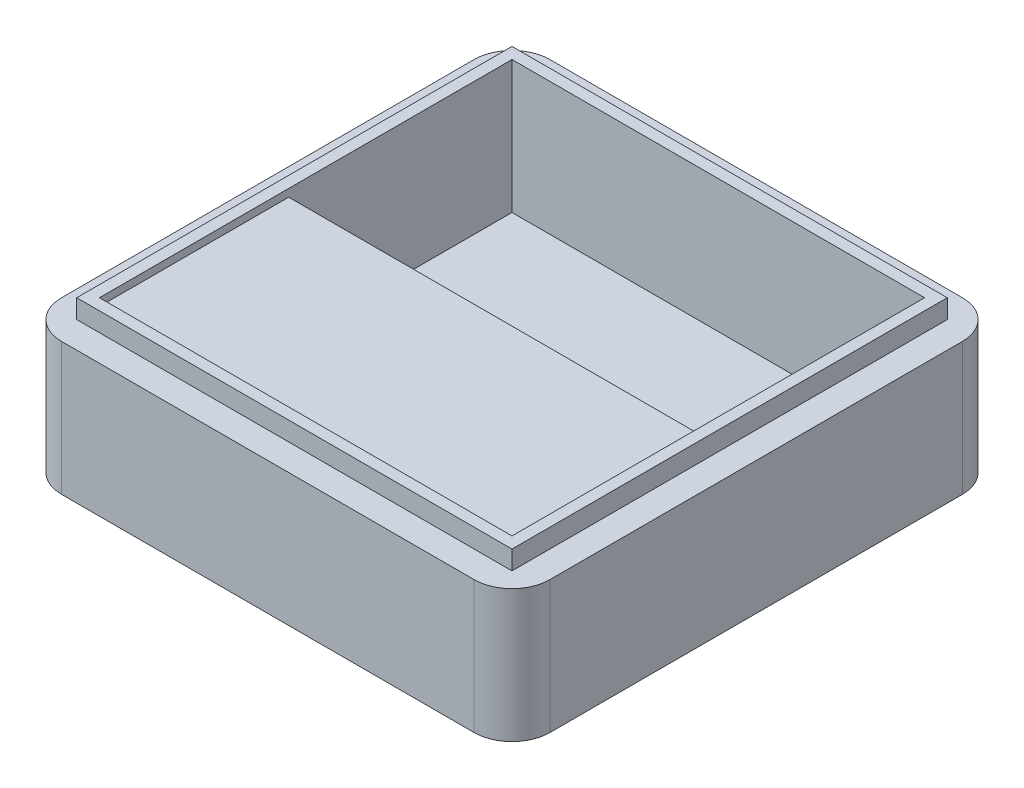
ISO-10303-21;
HEADER;
FILE_DESCRIPTION(('STEP AP214'),'2;1');
FILE_NAME('part.step','',(''),(''),'','','');
FILE_SCHEMA(('AUTOMOTIVE_DESIGN { 1 0 10303 214 1 1 1 1 }'));
ENDSEC;
DATA;
#1=APPLICATION_CONTEXT('core data for automotive mechanical design processes');
#2=APPLICATION_PROTOCOL_DEFINITION('international standard','automotive_design',2000,#1);
#3=PRODUCT_CONTEXT('',#1,'mechanical');
#4=PRODUCT('Part','Part','',(#3));
#5=PRODUCT_RELATED_PRODUCT_CATEGORY('part','',(#4));
#6=PRODUCT_DEFINITION_FORMATION('','',#4);
#7=PRODUCT_DEFINITION_CONTEXT('part definition',#1,'design');
#8=PRODUCT_DEFINITION('design','',#6,#7);
#9=PRODUCT_DEFINITION_SHAPE('','',#8);
#10=(LENGTH_UNIT() NAMED_UNIT(*) SI_UNIT(.MILLI.,.METRE.));
#11=(NAMED_UNIT(*) PLANE_ANGLE_UNIT() SI_UNIT($,.RADIAN.));
#12=(NAMED_UNIT(*) SI_UNIT($,.STERADIAN.) SOLID_ANGLE_UNIT());
#13=UNCERTAINTY_MEASURE_WITH_UNIT(LENGTH_MEASURE(1.E-05),#10,'distance_accuracy_value','');
#14=(GEOMETRIC_REPRESENTATION_CONTEXT(3) GLOBAL_UNCERTAINTY_ASSIGNED_CONTEXT((#13)) GLOBAL_UNIT_ASSIGNED_CONTEXT((#10,
#11,#12)) REPRESENTATION_CONTEXT('',''));
#15=CARTESIAN_POINT('',(0.,0.,0.));
#16=DIRECTION('',(0.,0.,1.));
#17=DIRECTION('',(1.,0.,0.));
#18=AXIS2_PLACEMENT_3D('',#15,#16,#17);
#19=CARTESIAN_POINT('',(-54.5,-189.149278298667,54.5));
#20=DIRECTION('',(0.,0.,1.));
#21=DIRECTION('',(1.,0.,0.));
#22=AXIS2_PLACEMENT_3D('',#19,#20,#21);
#23=PLANE('',#22);
#24=DIRECTION('',(1.,0.,0.));
#25=VECTOR('',#24,1.);
#26=CARTESIAN_POINT('',(54.5,3.,54.5));
#27=LINE('',#26,#25);
#28=CARTESIAN_POINT('',(-54.5,3.,54.5));
#29=VERTEX_POINT('',#28);
#30=CARTESIAN_POINT('',(54.5,3.,54.5));
#31=VERTEX_POINT('',#30);
#32=EDGE_CURVE('E176',#29,#31,#27,.T.);
#33=ORIENTED_EDGE('',*,*,#32,.F.);
#34=DIRECTION('',(0.,1.,0.));
#35=VECTOR('',#34,1.);
#36=CARTESIAN_POINT('',(-54.5,-189.149278298667,54.5));
#37=LINE('',#36,#35);
#38=CARTESIAN_POINT('',(-54.5,5.,54.5));
#39=VERTEX_POINT('',#38);
#40=EDGE_CURVE('E198',#29,#39,#37,.T.);
#41=ORIENTED_EDGE('',*,*,#40,.T.);
#42=DIRECTION('',(1.,0.,0.));
#43=VECTOR('',#42,1.);
#44=CARTESIAN_POINT('',(-54.5,5.,54.5));
#45=LINE('',#44,#43);
#46=CARTESIAN_POINT('',(54.5,5.,54.5));
#47=VERTEX_POINT('',#46);
#48=EDGE_CURVE('E202',#39,#47,#45,.T.);
#49=ORIENTED_EDGE('',*,*,#48,.T.);
#50=DIRECTION('',(0.,1.,0.));
#51=VECTOR('',#50,1.);
#52=CARTESIAN_POINT('',(54.5,-189.149278298667,54.5));
#53=LINE('',#52,#51);
#54=EDGE_CURVE('E218',#31,#47,#53,.T.);
#55=ORIENTED_EDGE('',*,*,#54,.F.);
#56=EDGE_LOOP('',(#33,#41,#49,#55));
#57=FACE_BOUND('',#56,.T.);
#58=ADVANCED_FACE('F41',(#57),#23,.F.);
#59=CARTESIAN_POINT('',(-54.5,-189.149278298667,-54.5));
#60=DIRECTION('',(-1.,0.,0.));
#61=DIRECTION('',(0.,0.,1.));
#62=AXIS2_PLACEMENT_3D('',#59,#60,#61);
#63=PLANE('',#62);
#64=DIRECTION('',(0.,0.,1.));
#65=VECTOR('',#64,1.);
#66=CARTESIAN_POINT('',(-54.5,3.,4.49999999999999));
#67=LINE('',#66,#65);
#68=CARTESIAN_POINT('',(-54.5,3.,4.49999999999999));
#69=VERTEX_POINT('',#68);
#70=EDGE_CURVE('E184',#69,#29,#67,.T.);
#71=ORIENTED_EDGE('',*,*,#70,.F.);
#72=DIRECTION('',(0.,1.,0.));
#73=VECTOR('',#72,1.);
#74=CARTESIAN_POINT('',(-54.5,3.,4.49999999999999));
#75=LINE('',#74,#73);
#76=CARTESIAN_POINT('',(-54.5,-30.,4.49999999999999));
#77=VERTEX_POINT('',#76);
#78=EDGE_CURVE('E169',#77,#69,#75,.T.);
#79=ORIENTED_EDGE('',*,*,#78,.F.);
#80=DIRECTION('',(0.,0.,-1.));
#81=VECTOR('',#80,1.);
#82=CARTESIAN_POINT('',(-54.5,-30.,-54.5));
#83=LINE('',#82,#81);
#84=CARTESIAN_POINT('',(-54.5,-30.,-54.5));
#85=VERTEX_POINT('',#84);
#86=EDGE_CURVE('E181',#77,#85,#83,.T.);
#87=ORIENTED_EDGE('',*,*,#86,.T.);
#88=DIRECTION('',(0.,1.,0.));
#89=VECTOR('',#88,1.);
#90=CARTESIAN_POINT('',(-54.5,-189.149278298667,-54.5));
#91=LINE('',#90,#89);
#92=CARTESIAN_POINT('',(-54.5,5.,-54.5));
#93=VERTEX_POINT('',#92);
#94=EDGE_CURVE('E221',#85,#93,#91,.T.);
#95=ORIENTED_EDGE('',*,*,#94,.T.);
#96=DIRECTION('',(0.,0.,1.));
#97=VECTOR('',#96,1.);
#98=CARTESIAN_POINT('',(-54.5,5.,-54.5));
#99=LINE('',#98,#97);
#100=EDGE_CURVE('E214',#93,#39,#99,.T.);
#101=ORIENTED_EDGE('',*,*,#100,.T.);
#102=ORIENTED_EDGE('',*,*,#40,.F.);
#103=EDGE_LOOP('',(#71,#79,#87,#95,#101,#102));
#104=FACE_BOUND('',#103,.T.);
#105=ADVANCED_FACE('F180',(#104),#63,.F.);
#106=CARTESIAN_POINT('',(54.5,-189.149278298667,54.5));
#107=DIRECTION('',(1.,0.,0.));
#108=DIRECTION('',(0.,0.,-1.));
#109=AXIS2_PLACEMENT_3D('',#106,#107,#108);
#110=PLANE('',#109);
#111=DIRECTION('',(0.,0.,1.));
#112=VECTOR('',#111,1.);
#113=CARTESIAN_POINT('',(54.5,3.,4.49999999999999));
#114=LINE('',#113,#112);
#115=CARTESIAN_POINT('',(54.5,3.,4.49999999999999));
#116=VERTEX_POINT('',#115);
#117=EDGE_CURVE('E574',#116,#31,#114,.T.);
#118=ORIENTED_EDGE('',*,*,#117,.T.);
#119=ORIENTED_EDGE('',*,*,#54,.T.);
#120=DIRECTION('',(0.,0.,-1.));
#121=VECTOR('',#120,1.);
#122=CARTESIAN_POINT('',(54.5,5.,54.5));
#123=LINE('',#122,#121);
#124=CARTESIAN_POINT('',(54.5,5.,-54.5));
#125=VERTEX_POINT('',#124);
#126=EDGE_CURVE('E206',#47,#125,#123,.T.);
#127=ORIENTED_EDGE('',*,*,#126,.T.);
#128=DIRECTION('',(0.,1.,0.));
#129=VECTOR('',#128,1.);
#130=CARTESIAN_POINT('',(54.5,-189.149278298667,-54.5));
#131=LINE('',#130,#129);
#132=CARTESIAN_POINT('',(54.5,-30.0000000000001,-54.5));
#133=VERTEX_POINT('',#132);
#134=EDGE_CURVE('E224',#133,#125,#131,.T.);
#135=ORIENTED_EDGE('',*,*,#134,.F.);
#136=DIRECTION('',(0.,0.,1.));
#137=VECTOR('',#136,1.);
#138=CARTESIAN_POINT('',(54.5,-30.,54.5));
#139=LINE('',#138,#137);
#140=CARTESIAN_POINT('',(54.5,-30.,4.49999999999999));
#141=VERTEX_POINT('',#140);
#142=EDGE_CURVE('E192',#133,#141,#139,.T.);
#143=ORIENTED_EDGE('',*,*,#142,.T.);
#144=DIRECTION('',(0.,-1.,0.));
#145=VECTOR('',#144,1.);
#146=CARTESIAN_POINT('',(54.5,-30.,4.49999999999999));
#147=LINE('',#146,#145);
#148=EDGE_CURVE('E57',#116,#141,#147,.T.);
#149=ORIENTED_EDGE('',*,*,#148,.F.);
#150=EDGE_LOOP('',(#118,#119,#127,#135,#143,#149));
#151=FACE_BOUND('',#150,.T.);
#152=ADVANCED_FACE('F397',(#151),#110,.F.);
#153=CARTESIAN_POINT('',(0.,-30.,0.));
#154=DIRECTION('',(0.,1.,0.));
#155=DIRECTION('',(0.,0.,1.));
#156=AXIS2_PLACEMENT_3D('',#153,#154,#155);
#157=PLANE('',#156);
#158=ORIENTED_EDGE('',*,*,#86,.F.);
#159=DIRECTION('',(-1.,0.,0.));
#160=VECTOR('',#159,1.);
#161=CARTESIAN_POINT('',(54.5,-30.,4.49999999999999));
#162=LINE('',#161,#160);
#163=EDGE_CURVE('E166',#141,#77,#162,.T.);
#164=ORIENTED_EDGE('',*,*,#163,.F.);
#165=ORIENTED_EDGE('',*,*,#142,.F.);
#166=DIRECTION('',(1.,0.,0.));
#167=VECTOR('',#166,1.);
#168=CARTESIAN_POINT('',(54.5,-30.,-54.5));
#169=LINE('',#168,#167);
#170=EDGE_CURVE('E189',#85,#133,#169,.T.);
#171=ORIENTED_EDGE('',*,*,#170,.F.);
#172=EDGE_LOOP('',(#158,#164,#165,#171));
#173=FACE_BOUND('',#172,.T.);
#174=ADVANCED_FACE('F188',(#173),#157,.T.);
#175=CARTESIAN_POINT('',(57.5,5.,57.5));
#176=DIRECTION('',(-1.,0.,0.));
#177=DIRECTION('',(0.,0.,1.));
#178=AXIS2_PLACEMENT_3D('',#175,#176,#177);
#179=PLANE('',#178);
#180=DIRECTION('',(0.,0.,-1.));
#181=VECTOR('',#180,1.);
#182=CARTESIAN_POINT('',(57.5,0.,57.5));
#183=LINE('',#182,#181);
#184=CARTESIAN_POINT('',(57.5,0.,57.5));
#185=VERTEX_POINT('',#184);
#186=CARTESIAN_POINT('',(57.5,0.,-57.5));
#187=VERTEX_POINT('',#186);
#188=EDGE_CURVE('E245',#185,#187,#183,.T.);
#189=ORIENTED_EDGE('',*,*,#188,.T.);
#190=DIRECTION('',(0.,-1.,0.));
#191=VECTOR('',#190,1.);
#192=CARTESIAN_POINT('',(57.5,5.,-57.5));
#193=LINE('',#192,#191);
#194=CARTESIAN_POINT('',(57.5,5.,-57.5));
#195=VERTEX_POINT('',#194);
#196=EDGE_CURVE('E299',#195,#187,#193,.T.);
#197=ORIENTED_EDGE('',*,*,#196,.F.);
#198=DIRECTION('',(0.,0.,-1.));
#199=VECTOR('',#198,1.);
#200=CARTESIAN_POINT('',(57.5,5.,57.5));
#201=LINE('',#200,#199);
#202=CARTESIAN_POINT('',(57.5,5.,57.5));
#203=VERTEX_POINT('',#202);
#204=EDGE_CURVE('E259',#203,#195,#201,.T.);
#205=ORIENTED_EDGE('',*,*,#204,.F.);
#206=DIRECTION('',(0.,-1.,0.));
#207=VECTOR('',#206,1.);
#208=CARTESIAN_POINT('',(57.5,5.,57.5));
#209=LINE('',#208,#207);
#210=EDGE_CURVE('E273',#203,#185,#209,.T.);
#211=ORIENTED_EDGE('',*,*,#210,.T.);
#212=EDGE_LOOP('',(#189,#197,#205,#211));
#213=FACE_BOUND('',#212,.T.);
#214=ADVANCED_FACE('F431',(#213),#179,.F.);
#215=CARTESIAN_POINT('',(-57.5,5.,-57.5));
#216=DIRECTION('',(0.,0.,1.));
#217=DIRECTION('',(1.,0.,0.));
#218=AXIS2_PLACEMENT_3D('',#215,#216,#217);
#219=PLANE('',#218);
#220=DIRECTION('',(-1.,0.,0.));
#221=VECTOR('',#220,1.);
#222=CARTESIAN_POINT('',(-57.5,0.,-57.5));
#223=LINE('',#222,#221);
#224=CARTESIAN_POINT('',(-57.5,0.,-57.5));
#225=VERTEX_POINT('',#224);
#226=EDGE_CURVE('E277',#187,#225,#223,.T.);
#227=ORIENTED_EDGE('',*,*,#226,.T.);
#228=DIRECTION('',(0.,-1.,0.));
#229=VECTOR('',#228,1.);
#230=CARTESIAN_POINT('',(-57.5,5.,-57.5));
#231=LINE('',#230,#229);
#232=CARTESIAN_POINT('',(-57.5,5.,-57.5));
#233=VERTEX_POINT('',#232);
#234=EDGE_CURVE('E295',#233,#225,#231,.T.);
#235=ORIENTED_EDGE('',*,*,#234,.F.);
#236=DIRECTION('',(-1.,0.,0.));
#237=VECTOR('',#236,1.);
#238=CARTESIAN_POINT('',(-57.5,5.,-57.5));
#239=LINE('',#238,#237);
#240=EDGE_CURVE('E263',#195,#233,#239,.T.);
#241=ORIENTED_EDGE('',*,*,#240,.F.);
#242=ORIENTED_EDGE('',*,*,#196,.T.);
#243=EDGE_LOOP('',(#227,#235,#241,#242));
#244=FACE_BOUND('',#243,.T.);
#245=ADVANCED_FACE('F427',(#244),#219,.F.);
#246=CARTESIAN_POINT('',(-57.5,5.,57.5));
#247=DIRECTION('',(1.,0.,0.));
#248=DIRECTION('',(0.,0.,-1.));
#249=AXIS2_PLACEMENT_3D('',#246,#247,#248);
#250=PLANE('',#249);
#251=DIRECTION('',(0.,0.,1.));
#252=VECTOR('',#251,1.);
#253=CARTESIAN_POINT('',(-57.5,0.,57.5));
#254=LINE('',#253,#252);
#255=CARTESIAN_POINT('',(-57.5,0.,57.5));
#256=VERTEX_POINT('',#255);
#257=EDGE_CURVE('E281',#225,#256,#254,.T.);
#258=ORIENTED_EDGE('',*,*,#257,.T.);
#259=DIRECTION('',(0.,-1.,0.));
#260=VECTOR('',#259,1.);
#261=CARTESIAN_POINT('',(-57.5,5.,57.5));
#262=LINE('',#261,#260);
#263=CARTESIAN_POINT('',(-57.5,5.,57.5));
#264=VERTEX_POINT('',#263);
#265=EDGE_CURVE('E291',#264,#256,#262,.T.);
#266=ORIENTED_EDGE('',*,*,#265,.F.);
#267=DIRECTION('',(0.,0.,1.));
#268=VECTOR('',#267,1.);
#269=CARTESIAN_POINT('',(-57.5,5.,57.5));
#270=LINE('',#269,#268);
#271=EDGE_CURVE('E267',#233,#264,#270,.T.);
#272=ORIENTED_EDGE('',*,*,#271,.F.);
#273=ORIENTED_EDGE('',*,*,#234,.T.);
#274=EDGE_LOOP('',(#258,#266,#272,#273));
#275=FACE_BOUND('',#274,.T.);
#276=ADVANCED_FACE('F423',(#275),#250,.F.);
#277=CARTESIAN_POINT('',(-57.5,5.,57.5));
#278=DIRECTION('',(0.,0.,-1.));
#279=DIRECTION('',(-1.,0.,0.));
#280=AXIS2_PLACEMENT_3D('',#277,#278,#279);
#281=PLANE('',#280);
#282=DIRECTION('',(1.,0.,0.));
#283=VECTOR('',#282,1.);
#284=CARTESIAN_POINT('',(-57.5,0.,57.5));
#285=LINE('',#284,#283);
#286=EDGE_CURVE('E264',#256,#185,#285,.T.);
#287=ORIENTED_EDGE('',*,*,#286,.T.);
#288=ORIENTED_EDGE('',*,*,#210,.F.);
#289=DIRECTION('',(1.,0.,0.));
#290=VECTOR('',#289,1.);
#291=CARTESIAN_POINT('',(-57.5,5.,57.5));
#292=LINE('',#291,#290);
#293=EDGE_CURVE('E270',#264,#203,#292,.T.);
#294=ORIENTED_EDGE('',*,*,#293,.F.);
#295=ORIENTED_EDGE('',*,*,#265,.T.);
#296=EDGE_LOOP('',(#287,#288,#294,#295));
#297=FACE_BOUND('',#296,.T.);
#298=ADVANCED_FACE('F419',(#297),#281,.F.);
#299=CARTESIAN_POINT('',(0.,5.,0.));
#300=DIRECTION('',(0.,-1.,0.));
#301=DIRECTION('',(0.,0.,-1.));
#302=AXIS2_PLACEMENT_3D('',#299,#300,#301);
#303=PLANE('',#302);
#304=ORIENTED_EDGE('',*,*,#126,.F.);
#305=ORIENTED_EDGE('',*,*,#48,.F.);
#306=ORIENTED_EDGE('',*,*,#100,.F.);
#307=DIRECTION('',(-1.,0.,0.));
#308=VECTOR('',#307,1.);
#309=CARTESIAN_POINT('',(54.5,5.,-54.5));
#310=LINE('',#309,#308);
#311=EDGE_CURVE('E210',#125,#93,#310,.T.);
#312=ORIENTED_EDGE('',*,*,#311,.F.);
#313=EDGE_LOOP('',(#304,#305,#306,#312));
#314=FACE_BOUND('',#313,.T.);
#315=ORIENTED_EDGE('',*,*,#204,.T.);
#316=ORIENTED_EDGE('',*,*,#240,.T.);
#317=ORIENTED_EDGE('',*,*,#271,.T.);
#318=ORIENTED_EDGE('',*,*,#293,.T.);
#319=EDGE_LOOP('',(#315,#316,#317,#318));
#320=FACE_BOUND('',#319,.T.);
#321=ADVANCED_FACE('F408',(#314,#320),#303,.F.);
#322=CARTESIAN_POINT('',(0.,0.,0.));
#323=DIRECTION('',(0.,1.,0.));
#324=DIRECTION('',(0.,0.,1.));
#325=AXIS2_PLACEMENT_3D('',#322,#323,#324);
#326=PLANE('',#325);
#327=DIRECTION('',(0.,0.,-1.));
#328=VECTOR('',#327,1.);
#329=CARTESIAN_POINT('',(-64.5,0.,-64.5));
#330=LINE('',#329,#328);
#331=CARTESIAN_POINT('',(-64.5,0.,54.5));
#332=VERTEX_POINT('',#331);
#333=CARTESIAN_POINT('',(-64.5,0.,-54.5));
#334=VERTEX_POINT('',#333);
#335=EDGE_CURVE('E253',#332,#334,#330,.T.);
#336=ORIENTED_EDGE('',*,*,#335,.F.);
#337=CARTESIAN_POINT('',(-54.5,0.,54.5));
#338=DIRECTION('',(0.,1.,0.));
#339=DIRECTION('',(0.,0.,1.));
#340=AXIS2_PLACEMENT_3D('',#337,#338,#339);
#341=CIRCLE('',#340,10.);
#342=CARTESIAN_POINT('',(-54.5,0.,64.5));
#343=VERTEX_POINT('',#342);
#344=EDGE_CURVE('E319',#332,#343,#341,.T.);
#345=ORIENTED_EDGE('',*,*,#344,.T.);
#346=DIRECTION('',(-1.,0.,0.));
#347=VECTOR('',#346,1.);
#348=CARTESIAN_POINT('',(-64.5,0.,64.5));
#349=LINE('',#348,#347);
#350=CARTESIAN_POINT('',(54.5,0.,64.5));
#351=VERTEX_POINT('',#350);
#352=EDGE_CURVE('E249',#351,#343,#349,.T.);
#353=ORIENTED_EDGE('',*,*,#352,.F.);
#354=CARTESIAN_POINT('',(54.5,0.,54.5));
#355=DIRECTION('',(0.,1.,0.));
#356=DIRECTION('',(0.,0.,1.));
#357=AXIS2_PLACEMENT_3D('',#354,#355,#356);
#358=CIRCLE('',#357,10.);
#359=CARTESIAN_POINT('',(64.5,0.,54.5));
#360=VERTEX_POINT('',#359);
#361=EDGE_CURVE('E310',#351,#360,#358,.T.);
#362=ORIENTED_EDGE('',*,*,#361,.T.);
#363=DIRECTION('',(0.,0.,1.));
#364=VECTOR('',#363,1.);
#365=CARTESIAN_POINT('',(64.5,0.,-64.5));
#366=LINE('',#365,#364);
#367=CARTESIAN_POINT('',(64.5,0.,-54.5));
#368=VERTEX_POINT('',#367);
#369=EDGE_CURVE('E196',#368,#360,#366,.T.);
#370=ORIENTED_EDGE('',*,*,#369,.F.);
#371=CARTESIAN_POINT('',(54.5,0.,-54.5));
#372=DIRECTION('',(0.,1.,0.));
#373=DIRECTION('',(0.,0.,1.));
#374=AXIS2_PLACEMENT_3D('',#371,#372,#373);
#375=CIRCLE('',#374,10.);
#376=CARTESIAN_POINT('',(54.5,0.,-64.5));
#377=VERTEX_POINT('',#376);
#378=EDGE_CURVE('E313',#368,#377,#375,.T.);
#379=ORIENTED_EDGE('',*,*,#378,.T.);
#380=DIRECTION('',(1.,0.,0.));
#381=VECTOR('',#380,1.);
#382=CARTESIAN_POINT('',(-64.5,0.,-64.5));
#383=LINE('',#382,#381);
#384=CARTESIAN_POINT('',(-54.5,0.,-64.5));
#385=VERTEX_POINT('',#384);
#386=EDGE_CURVE('E234',#385,#377,#383,.T.);
#387=ORIENTED_EDGE('',*,*,#386,.F.);
#388=CARTESIAN_POINT('',(-54.5,0.,-54.5));
#389=DIRECTION('',(0.,1.,0.));
#390=DIRECTION('',(0.,0.,1.));
#391=AXIS2_PLACEMENT_3D('',#388,#389,#390);
#392=CIRCLE('',#391,10.);
#393=EDGE_CURVE('E316',#385,#334,#392,.T.);
#394=ORIENTED_EDGE('',*,*,#393,.T.);
#395=EDGE_LOOP('',(#336,#345,#353,#362,#370,#379,#387,#394));
#396=FACE_BOUND('',#395,.T.);
#397=ORIENTED_EDGE('',*,*,#188,.F.);
#398=ORIENTED_EDGE('',*,*,#286,.F.);
#399=ORIENTED_EDGE('',*,*,#257,.F.);
#400=ORIENTED_EDGE('',*,*,#226,.F.);
#401=EDGE_LOOP('',(#397,#398,#399,#400));
#402=FACE_BOUND('',#401,.T.);
#403=ADVANCED_FACE('F366',(#396,#402),#326,.T.);
#404=CARTESIAN_POINT('',(64.5,-35.,-64.5));
#405=DIRECTION('',(-1.,0.,0.));
#406=DIRECTION('',(0.,0.,1.));
#407=AXIS2_PLACEMENT_3D('',#404,#405,#406);
#408=PLANE('',#407);
#409=DIRECTION('',(0.,0.,1.));
#410=VECTOR('',#409,1.);
#411=CARTESIAN_POINT('',(64.5,-35.,-64.5));
#412=LINE('',#411,#410);
#413=CARTESIAN_POINT('',(64.5,-35.,-54.5));
#414=VERTEX_POINT('',#413);
#415=CARTESIAN_POINT('',(64.5,-35.,54.5));
#416=VERTEX_POINT('',#415);
#417=EDGE_CURVE('E229',#414,#416,#412,.T.);
#418=ORIENTED_EDGE('',*,*,#417,.F.);
#419=DIRECTION('',(0.,1.,0.));
#420=VECTOR('',#419,1.);
#421=CARTESIAN_POINT('',(64.5,-35.,-54.5));
#422=LINE('',#421,#420);
#423=EDGE_CURVE('E12',#414,#368,#422,.T.);
#424=ORIENTED_EDGE('',*,*,#423,.T.);
#425=ORIENTED_EDGE('',*,*,#369,.T.);
#426=DIRECTION('',(0.,1.,0.));
#427=VECTOR('',#426,1.);
#428=CARTESIAN_POINT('',(64.5,-35.,54.5));
#429=LINE('',#428,#427);
#430=EDGE_CURVE('E50',#360,#416,#429,.F.);
#431=ORIENTED_EDGE('',*,*,#430,.T.);
#432=EDGE_LOOP('',(#418,#424,#425,#431));
#433=FACE_BOUND('',#432,.T.);
#434=ADVANCED_FACE('F350',(#433),#408,.F.);
#435=CARTESIAN_POINT('',(-64.5,-35.,64.5));
#436=DIRECTION('',(0.,0.,-1.));
#437=DIRECTION('',(-1.,0.,0.));
#438=AXIS2_PLACEMENT_3D('',#435,#436,#437);
#439=PLANE('',#438);
#440=ORIENTED_EDGE('',*,*,#352,.T.);
#441=DIRECTION('',(0.,1.,0.));
#442=VECTOR('',#441,1.);
#443=CARTESIAN_POINT('',(-54.5,-35.,64.5));
#444=LINE('',#443,#442);
#445=CARTESIAN_POINT('',(-54.5,-35.,64.5));
#446=VERTEX_POINT('',#445);
#447=EDGE_CURVE('E326',#343,#446,#444,.F.);
#448=ORIENTED_EDGE('',*,*,#447,.T.);
#449=DIRECTION('',(-1.,0.,0.));
#450=VECTOR('',#449,1.);
#451=CARTESIAN_POINT('',(-64.5,-35.,64.5));
#452=LINE('',#451,#450);
#453=CARTESIAN_POINT('',(54.5,-35.,64.5));
#454=VERTEX_POINT('',#453);
#455=EDGE_CURVE('E233',#454,#446,#452,.T.);
#456=ORIENTED_EDGE('',*,*,#455,.F.);
#457=DIRECTION('',(0.,1.,0.));
#458=VECTOR('',#457,1.);
#459=CARTESIAN_POINT('',(54.5,-35.,64.5));
#460=LINE('',#459,#458);
#461=EDGE_CURVE('E322',#454,#351,#460,.T.);
#462=ORIENTED_EDGE('',*,*,#461,.T.);
#463=EDGE_LOOP('',(#440,#448,#456,#462));
#464=FACE_BOUND('',#463,.T.);
#465=ADVANCED_FACE('F362',(#464),#439,.F.);
#466=CARTESIAN_POINT('',(-64.5,-35.,-64.5));
#467=DIRECTION('',(1.,0.,0.));
#468=DIRECTION('',(0.,0.,-1.));
#469=AXIS2_PLACEMENT_3D('',#466,#467,#468);
#470=PLANE('',#469);
#471=DIRECTION('',(0.,0.,-1.));
#472=VECTOR('',#471,1.);
#473=CARTESIAN_POINT('',(-64.5,-35.,-64.5));
#474=LINE('',#473,#472);
#475=CARTESIAN_POINT('',(-64.5,-35.,54.5));
#476=VERTEX_POINT('',#475);
#477=CARTESIAN_POINT('',(-64.5,-35.,-54.5));
#478=VERTEX_POINT('',#477);
#479=EDGE_CURVE('E238',#476,#478,#474,.T.);
#480=ORIENTED_EDGE('',*,*,#479,.F.);
#481=DIRECTION('',(0.,1.,0.));
#482=VECTOR('',#481,1.);
#483=CARTESIAN_POINT('',(-64.5,-35.,54.5));
#484=LINE('',#483,#482);
#485=EDGE_CURVE('E306',#476,#332,#484,.T.);
#486=ORIENTED_EDGE('',*,*,#485,.T.);
#487=ORIENTED_EDGE('',*,*,#335,.T.);
#488=DIRECTION('',(0.,1.,0.));
#489=VECTOR('',#488,1.);
#490=CARTESIAN_POINT('',(-64.5,-35.,-54.5));
#491=LINE('',#490,#489);
#492=EDGE_CURVE('E303',#334,#478,#491,.F.);
#493=ORIENTED_EDGE('',*,*,#492,.T.);
#494=EDGE_LOOP('',(#480,#486,#487,#493));
#495=FACE_BOUND('',#494,.T.);
#496=ADVANCED_FACE('F374',(#495),#470,.F.);
#497=CARTESIAN_POINT('',(-64.5,-35.,-64.5));
#498=DIRECTION('',(0.,0.,1.));
#499=DIRECTION('',(1.,0.,0.));
#500=AXIS2_PLACEMENT_3D('',#497,#498,#499);
#501=PLANE('',#500);
#502=DIRECTION('',(1.,0.,0.));
#503=VECTOR('',#502,1.);
#504=CARTESIAN_POINT('',(-64.5,-35.,-64.5));
#505=LINE('',#504,#503);
#506=CARTESIAN_POINT('',(-54.5,-35.,-64.5));
#507=VERTEX_POINT('',#506);
#508=CARTESIAN_POINT('',(54.5,-35.,-64.5));
#509=VERTEX_POINT('',#508);
#510=EDGE_CURVE('E242',#507,#509,#505,.T.);
#511=ORIENTED_EDGE('',*,*,#510,.F.);
#512=DIRECTION('',(0.,1.,0.));
#513=VECTOR('',#512,1.);
#514=CARTESIAN_POINT('',(-54.5,-35.,-64.5));
#515=LINE('',#514,#513);
#516=EDGE_CURVE('E343',#507,#385,#515,.T.);
#517=ORIENTED_EDGE('',*,*,#516,.T.);
#518=ORIENTED_EDGE('',*,*,#386,.T.);
#519=DIRECTION('',(0.,1.,0.));
#520=VECTOR('',#519,1.);
#521=CARTESIAN_POINT('',(54.5,-35.,-64.5));
#522=LINE('',#521,#520);
#523=EDGE_CURVE('E65',#377,#509,#522,.F.);
#524=ORIENTED_EDGE('',*,*,#523,.T.);
#525=EDGE_LOOP('',(#511,#517,#518,#524));
#526=FACE_BOUND('',#525,.T.);
#527=ADVANCED_FACE('F381',(#526),#501,.F.);
#528=CARTESIAN_POINT('',(0.,-35.,0.));
#529=DIRECTION('',(0.,1.,0.));
#530=DIRECTION('',(0.,0.,1.));
#531=AXIS2_PLACEMENT_3D('',#528,#529,#530);
#532=PLANE('',#531);
#533=ORIENTED_EDGE('',*,*,#455,.T.);
#534=CARTESIAN_POINT('',(-54.5,-35.,54.5));
#535=DIRECTION('',(0.,1.,0.));
#536=DIRECTION('',(0.,0.,1.));
#537=AXIS2_PLACEMENT_3D('',#534,#535,#536);
#538=CIRCLE('',#537,10.);
#539=EDGE_CURVE('E338',#446,#476,#538,.F.);
#540=ORIENTED_EDGE('',*,*,#539,.T.);
#541=ORIENTED_EDGE('',*,*,#479,.T.);
#542=CARTESIAN_POINT('',(-54.5,-35.,-54.5));
#543=DIRECTION('',(0.,1.,0.));
#544=DIRECTION('',(0.,0.,1.));
#545=AXIS2_PLACEMENT_3D('',#542,#543,#544);
#546=CIRCLE('',#545,10.);
#547=EDGE_CURVE('E335',#478,#507,#546,.F.);
#548=ORIENTED_EDGE('',*,*,#547,.T.);
#549=ORIENTED_EDGE('',*,*,#510,.T.);
#550=CARTESIAN_POINT('',(54.5,-35.,-54.5));
#551=DIRECTION('',(0.,1.,0.));
#552=DIRECTION('',(0.,0.,1.));
#553=AXIS2_PLACEMENT_3D('',#550,#551,#552);
#554=CIRCLE('',#553,10.);
#555=EDGE_CURVE('E332',#509,#414,#554,.F.);
#556=ORIENTED_EDGE('',*,*,#555,.T.);
#557=ORIENTED_EDGE('',*,*,#417,.T.);
#558=CARTESIAN_POINT('',(54.5,-35.,54.5));
#559=DIRECTION('',(0.,1.,0.));
#560=DIRECTION('',(0.,0.,1.));
#561=AXIS2_PLACEMENT_3D('',#558,#559,#560);
#562=CIRCLE('',#561,10.);
#563=EDGE_CURVE('E329',#416,#454,#562,.F.);
#564=ORIENTED_EDGE('',*,*,#563,.T.);
#565=EDGE_LOOP('',(#533,#540,#541,#548,#549,#556,#557,#564));
#566=FACE_BOUND('',#565,.T.);
#567=ADVANCED_FACE('F356',(#566),#532,.F.);
#568=CARTESIAN_POINT('',(54.5,-189.149278298667,-54.5));
#569=DIRECTION('',(0.,0.,-1.));
#570=DIRECTION('',(-1.,0.,0.));
#571=AXIS2_PLACEMENT_3D('',#568,#569,#570);
#572=PLANE('',#571);
#573=ORIENTED_EDGE('',*,*,#170,.T.);
#574=ORIENTED_EDGE('',*,*,#134,.T.);
#575=ORIENTED_EDGE('',*,*,#311,.T.);
#576=ORIENTED_EDGE('',*,*,#94,.F.);
#577=EDGE_LOOP('',(#573,#574,#575,#576));
#578=FACE_BOUND('',#577,.T.);
#579=ADVANCED_FACE('F405',(#578),#572,.F.);
#580=CARTESIAN_POINT('',(-54.5,-35.,54.5));
#581=DIRECTION('',(0.,1.,0.));
#582=DIRECTION('',(0.,0.,1.));
#583=AXIS2_PLACEMENT_3D('',#580,#581,#582);
#584=CYLINDRICAL_SURFACE('',#583,10.);
#585=ORIENTED_EDGE('',*,*,#539,.F.);
#586=ORIENTED_EDGE('',*,*,#447,.F.);
#587=ORIENTED_EDGE('',*,*,#344,.F.);
#588=ORIENTED_EDGE('',*,*,#485,.F.);
#589=EDGE_LOOP('',(#585,#586,#587,#588));
#590=FACE_BOUND('',#589,.T.);
#591=ADVANCED_FACE('F371',(#590),#584,.T.);
#592=CARTESIAN_POINT('',(-54.5,-35.,-54.5));
#593=DIRECTION('',(0.,1.,0.));
#594=DIRECTION('',(0.,0.,1.));
#595=AXIS2_PLACEMENT_3D('',#592,#593,#594);
#596=CYLINDRICAL_SURFACE('',#595,10.);
#597=ORIENTED_EDGE('',*,*,#547,.F.);
#598=ORIENTED_EDGE('',*,*,#492,.F.);
#599=ORIENTED_EDGE('',*,*,#393,.F.);
#600=ORIENTED_EDGE('',*,*,#516,.F.);
#601=EDGE_LOOP('',(#597,#598,#599,#600));
#602=FACE_BOUND('',#601,.T.);
#603=ADVANCED_FACE('F379',(#602),#596,.T.);
#604=CARTESIAN_POINT('',(54.5,-35.,-54.5));
#605=DIRECTION('',(0.,1.,0.));
#606=DIRECTION('',(0.,0.,1.));
#607=AXIS2_PLACEMENT_3D('',#604,#605,#606);
#608=CYLINDRICAL_SURFACE('',#607,10.);
#609=ORIENTED_EDGE('',*,*,#555,.F.);
#610=ORIENTED_EDGE('',*,*,#523,.F.);
#611=ORIENTED_EDGE('',*,*,#378,.F.);
#612=ORIENTED_EDGE('',*,*,#423,.F.);
#613=EDGE_LOOP('',(#609,#610,#611,#612));
#614=FACE_BOUND('',#613,.T.);
#615=ADVANCED_FACE('F383',(#614),#608,.T.);
#616=CARTESIAN_POINT('',(54.5,-35.,54.5));
#617=DIRECTION('',(0.,1.,0.));
#618=DIRECTION('',(0.,0.,1.));
#619=AXIS2_PLACEMENT_3D('',#616,#617,#618);
#620=CYLINDRICAL_SURFACE('',#619,10.);
#621=ORIENTED_EDGE('',*,*,#563,.F.);
#622=ORIENTED_EDGE('',*,*,#430,.F.);
#623=ORIENTED_EDGE('',*,*,#361,.F.);
#624=ORIENTED_EDGE('',*,*,#461,.F.);
#625=EDGE_LOOP('',(#621,#622,#623,#624));
#626=FACE_BOUND('',#625,.T.);
#627=ADVANCED_FACE('F43',(#626),#620,.T.);
#628=CARTESIAN_POINT('',(54.5,3.,4.49999999999999));
#629=DIRECTION('',(0.,-1.,0.));
#630=DIRECTION('',(0.,0.,-1.));
#631=AXIS2_PLACEMENT_3D('',#628,#629,#630);
#632=PLANE('',#631);
#633=ORIENTED_EDGE('',*,*,#32,.T.);
#634=ORIENTED_EDGE('',*,*,#117,.F.);
#635=DIRECTION('',(1.,0.,0.));
#636=VECTOR('',#635,1.);
#637=CARTESIAN_POINT('',(54.5,3.,4.49999999999999));
#638=LINE('',#637,#636);
#639=EDGE_CURVE('E186',#69,#116,#638,.T.);
#640=ORIENTED_EDGE('',*,*,#639,.F.);
#641=ORIENTED_EDGE('',*,*,#70,.T.);
#642=EDGE_LOOP('',(#633,#634,#640,#641));
#643=FACE_BOUND('',#642,.T.);
#644=ADVANCED_FACE('F389',(#643),#632,.F.);
#645=CARTESIAN_POINT('',(0.,0.,4.49999999999999));
#646=DIRECTION('',(0.,0.,1.));
#647=DIRECTION('',(1.,0.,0.));
#648=AXIS2_PLACEMENT_3D('',#645,#646,#647);
#649=PLANE('',#648);
#650=ORIENTED_EDGE('',*,*,#163,.T.);
#651=ORIENTED_EDGE('',*,*,#78,.T.);
#652=ORIENTED_EDGE('',*,*,#639,.T.);
#653=ORIENTED_EDGE('',*,*,#148,.T.);
#654=EDGE_LOOP('',(#650,#651,#652,#653));
#655=FACE_BOUND('',#654,.T.);
#656=ADVANCED_FACE('F168',(#655),#649,.F.);
#657=CLOSED_SHELL('',(#58,#105,#152,#174,#214,#245,#276,#298,#321,#403,#434,#465,#496,#527,#567,
#579,#591,#603,#615,#627,#644,#656));
#658=MANIFOLD_SOLID_BREP('B2',#657);
#659=ADVANCED_BREP_SHAPE_REPRESENTATION('',(#18,#658),#14);
#660=SHAPE_DEFINITION_REPRESENTATION(#9,#659);
ENDSEC;
END-ISO-10303-21;
